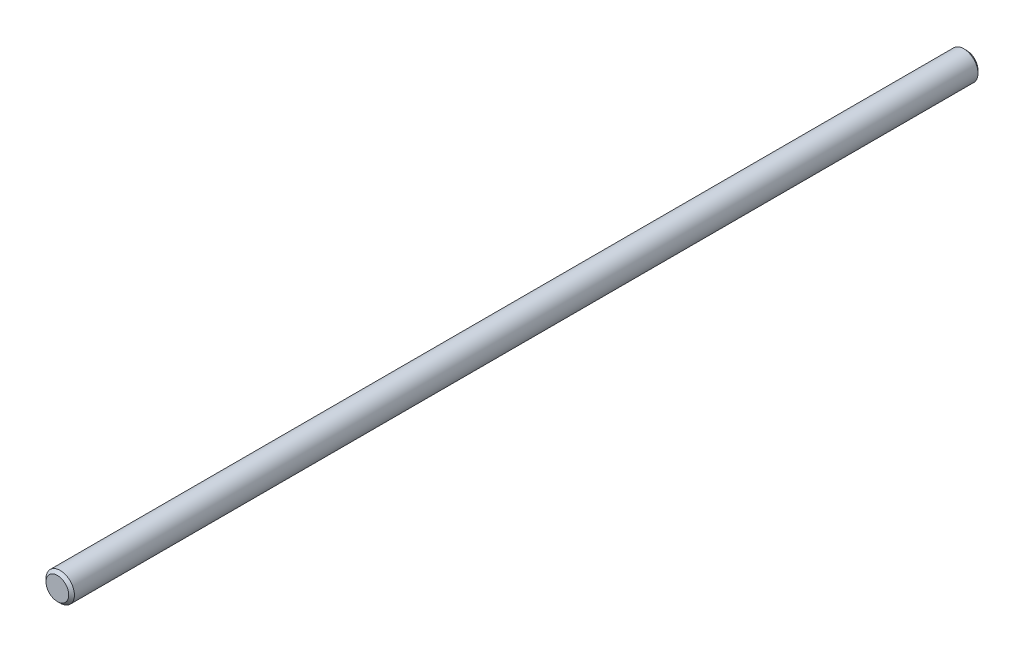
ISO-10303-21;
HEADER;
FILE_DESCRIPTION(('STEP AP214'),'2;1');
FILE_NAME('part.step','',(''),(''),'','','');
FILE_SCHEMA(('AUTOMOTIVE_DESIGN { 1 0 10303 214 1 1 1 1 }'));
ENDSEC;
DATA;
#1=APPLICATION_CONTEXT('core data for automotive mechanical design processes');
#2=APPLICATION_PROTOCOL_DEFINITION('international standard','automotive_design',2000,#1);
#3=PRODUCT_CONTEXT('',#1,'mechanical');
#4=PRODUCT('Part','Part','',(#3));
#5=PRODUCT_RELATED_PRODUCT_CATEGORY('part','',(#4));
#6=PRODUCT_DEFINITION_FORMATION('','',#4);
#7=PRODUCT_DEFINITION_CONTEXT('part definition',#1,'design');
#8=PRODUCT_DEFINITION('design','',#6,#7);
#9=PRODUCT_DEFINITION_SHAPE('','',#8);
#10=(LENGTH_UNIT() NAMED_UNIT(*) SI_UNIT(.MILLI.,.METRE.));
#11=(NAMED_UNIT(*) PLANE_ANGLE_UNIT() SI_UNIT($,.RADIAN.));
#12=(NAMED_UNIT(*) SI_UNIT($,.STERADIAN.) SOLID_ANGLE_UNIT());
#13=UNCERTAINTY_MEASURE_WITH_UNIT(LENGTH_MEASURE(1.E-05),#10,'distance_accuracy_value','');
#14=(GEOMETRIC_REPRESENTATION_CONTEXT(3) GLOBAL_UNCERTAINTY_ASSIGNED_CONTEXT((#13)) GLOBAL_UNIT_ASSIGNED_CONTEXT((#10,
#11,#12)) REPRESENTATION_CONTEXT('',''));
#15=CARTESIAN_POINT('',(0.,0.,0.));
#16=DIRECTION('',(0.,0.,1.));
#17=DIRECTION('',(1.,0.,0.));
#18=AXIS2_PLACEMENT_3D('',#15,#16,#17);
#19=CARTESIAN_POINT('',(0.,0.,152.4));
#20=DIRECTION('',(0.,0.,-1.));
#21=DIRECTION('',(-1.,0.,0.));
#22=AXIS2_PLACEMENT_3D('',#19,#20,#21);
#23=CYLINDRICAL_SURFACE('',#22,4.7625);
#24=CARTESIAN_POINT('',(0.,0.,-151.4475));
#25=DIRECTION('',(0.,0.,1.));
#26=DIRECTION('',(1.,0.,0.));
#27=AXIS2_PLACEMENT_3D('',#24,#25,#26);
#28=CIRCLE('',#27,4.7625);
#29=CARTESIAN_POINT('',(4.7625,0.,-151.4475));
#30=VERTEX_POINT('',#29);
#31=EDGE_CURVE('E41',#30,#30,#28,.T.);
#32=ORIENTED_EDGE('',*,*,#31,.T.);
#33=EDGE_LOOP('',(#32));
#34=FACE_BOUND('',#33,.T.);
#35=CARTESIAN_POINT('',(0.,0.,151.4475));
#36=DIRECTION('',(0.,0.,1.));
#37=DIRECTION('',(1.,0.,0.));
#38=AXIS2_PLACEMENT_3D('',#35,#36,#37);
#39=CIRCLE('',#38,4.7625);
#40=CARTESIAN_POINT('',(4.7625,0.,151.4475));
#41=VERTEX_POINT('',#40);
#42=EDGE_CURVE('E45',#41,#41,#39,.F.);
#43=ORIENTED_EDGE('',*,*,#42,.T.);
#44=EDGE_LOOP('',(#43));
#45=FACE_BOUND('',#44,.T.);
#46=ADVANCED_FACE('F30',(#34,#45),#23,.T.);
#47=CARTESIAN_POINT('',(0.,0.,152.4));
#48=DIRECTION('',(0.,0.,1.));
#49=DIRECTION('',(1.,0.,0.));
#50=AXIS2_PLACEMENT_3D('',#47,#48,#49);
#51=PLANE('',#50);
#52=CARTESIAN_POINT('',(0.,0.,152.4));
#53=DIRECTION('',(0.,0.,1.));
#54=DIRECTION('',(1.,0.,0.));
#55=AXIS2_PLACEMENT_3D('',#52,#53,#54);
#56=CIRCLE('',#55,3.81000000000012);
#57=CARTESIAN_POINT('',(3.81000000000012,0.,152.4));
#58=VERTEX_POINT('',#57);
#59=EDGE_CURVE('E10',#58,#58,#56,.T.);
#60=ORIENTED_EDGE('',*,*,#59,.T.);
#61=EDGE_LOOP('',(#60));
#62=FACE_BOUND('',#61,.T.);
#63=ADVANCED_FACE('F61',(#62),#51,.T.);
#64=CARTESIAN_POINT('',(0.,0.,-152.4));
#65=DIRECTION('',(0.,0.,1.));
#66=DIRECTION('',(1.,0.,0.));
#67=AXIS2_PLACEMENT_3D('',#64,#65,#66);
#68=PLANE('',#67);
#69=CARTESIAN_POINT('',(0.,0.,-152.4));
#70=DIRECTION('',(0.,0.,1.));
#71=DIRECTION('',(1.,0.,0.));
#72=AXIS2_PLACEMENT_3D('',#69,#70,#71);
#73=CIRCLE('',#72,3.8099999999997);
#74=CARTESIAN_POINT('',(3.8099999999997,0.,-152.4));
#75=VERTEX_POINT('',#74);
#76=EDGE_CURVE('E37',#75,#75,#73,.F.);
#77=ORIENTED_EDGE('',*,*,#76,.T.);
#78=EDGE_LOOP('',(#77));
#79=FACE_BOUND('',#78,.T.);
#80=ADVANCED_FACE('F58',(#79),#68,.F.);
#81=CARTESIAN_POINT('',(0.,0.,-151.4475));
#82=DIRECTION('',(0.,0.,1.));
#83=DIRECTION('',(1.,0.,0.));
#84=AXIS2_PLACEMENT_3D('',#81,#82,#83);
#85=CONICAL_SURFACE('',#84,4.7625,0.785398163397447);
#86=ORIENTED_EDGE('',*,*,#76,.F.);
#87=EDGE_LOOP('',(#86));
#88=FACE_BOUND('',#87,.T.);
#89=ORIENTED_EDGE('',*,*,#31,.F.);
#90=EDGE_LOOP('',(#89));
#91=FACE_BOUND('',#90,.T.);
#92=ADVANCED_FACE('F54',(#88,#91),#85,.T.);
#93=CARTESIAN_POINT('',(0.,0.,152.4));
#94=DIRECTION('',(0.,0.,-1.));
#95=DIRECTION('',(-1.,0.,0.));
#96=AXIS2_PLACEMENT_3D('',#93,#94,#95);
#97=CONICAL_SURFACE('',#96,3.81000000000012,0.785398163397447);
#98=ORIENTED_EDGE('',*,*,#42,.F.);
#99=EDGE_LOOP('',(#98));
#100=FACE_BOUND('',#99,.T.);
#101=ORIENTED_EDGE('',*,*,#59,.F.);
#102=EDGE_LOOP('',(#101));
#103=FACE_BOUND('',#102,.T.);
#104=ADVANCED_FACE('F32',(#100,#103),#97,.T.);
#105=CLOSED_SHELL('',(#46,#63,#80,#92,#104));
#106=MANIFOLD_SOLID_BREP('B2',#105);
#107=ADVANCED_BREP_SHAPE_REPRESENTATION('',(#18,#106),#14);
#108=SHAPE_DEFINITION_REPRESENTATION(#9,#107);
ENDSEC;
END-ISO-10303-21;
